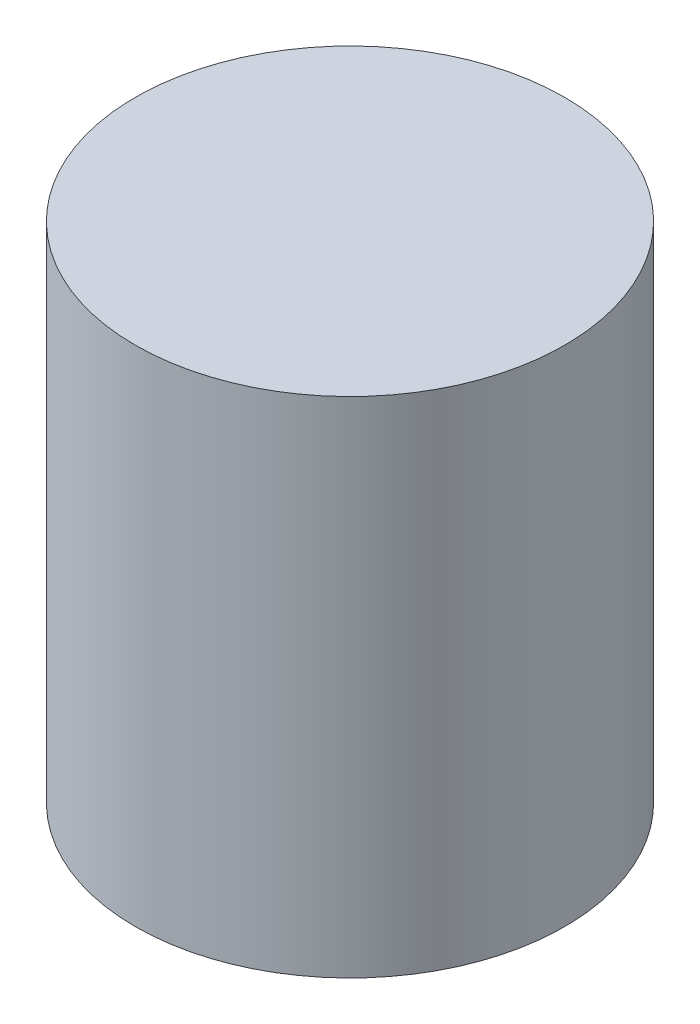
ISO-10303-21;
HEADER;
FILE_DESCRIPTION(('STEP AP214'),'2;1');
FILE_NAME('part.step','',(''),(''),'','','');
FILE_SCHEMA(('AUTOMOTIVE_DESIGN { 1 0 10303 214 1 1 1 1 }'));
ENDSEC;
DATA;
#1=APPLICATION_CONTEXT('core data for automotive mechanical design processes');
#2=APPLICATION_PROTOCOL_DEFINITION('international standard','automotive_design',2000,#1);
#3=PRODUCT_CONTEXT('',#1,'mechanical');
#4=PRODUCT('Part','Part','',(#3));
#5=PRODUCT_RELATED_PRODUCT_CATEGORY('part','',(#4));
#6=PRODUCT_DEFINITION_FORMATION('','',#4);
#7=PRODUCT_DEFINITION_CONTEXT('part definition',#1,'design');
#8=PRODUCT_DEFINITION('design','',#6,#7);
#9=PRODUCT_DEFINITION_SHAPE('','',#8);
#10=(LENGTH_UNIT() NAMED_UNIT(*) SI_UNIT(.MILLI.,.METRE.));
#11=(NAMED_UNIT(*) PLANE_ANGLE_UNIT() SI_UNIT($,.RADIAN.));
#12=(NAMED_UNIT(*) SI_UNIT($,.STERADIAN.) SOLID_ANGLE_UNIT());
#13=UNCERTAINTY_MEASURE_WITH_UNIT(LENGTH_MEASURE(1.E-05),#10,'distance_accuracy_value','');
#14=(GEOMETRIC_REPRESENTATION_CONTEXT(3) GLOBAL_UNCERTAINTY_ASSIGNED_CONTEXT((#13)) GLOBAL_UNIT_ASSIGNED_CONTEXT((#10,
#11,#12)) REPRESENTATION_CONTEXT('',''));
#15=CARTESIAN_POINT('',(0.,0.,0.));
#16=DIRECTION('',(0.,0.,1.));
#17=DIRECTION('',(1.,0.,0.));
#18=AXIS2_PLACEMENT_3D('',#15,#16,#17);
#19=CARTESIAN_POINT('',(0.,0.,0.));
#20=DIRECTION('',(0.,1.,0.));
#21=DIRECTION('',(0.,0.,1.));
#22=AXIS2_PLACEMENT_3D('',#19,#20,#21);
#23=PLANE('',#22);
#24=CARTESIAN_POINT('',(0.,0.,0.));
#25=DIRECTION('',(0.,1.,0.));
#26=DIRECTION('',(0.,0.,1.));
#27=AXIS2_PLACEMENT_3D('',#24,#25,#26);
#28=CIRCLE('',#27,4.05);
#29=CARTESIAN_POINT('',(0.,0.,4.05));
#30=VERTEX_POINT('',#29);
#31=EDGE_CURVE('E10',#30,#30,#28,.T.);
#32=ORIENTED_EDGE('',*,*,#31,.F.);
#33=EDGE_LOOP('',(#32));
#34=FACE_BOUND('',#33,.T.);
#35=CARTESIAN_POINT('',(0.,0.,0.));
#36=DIRECTION('',(0.,1.,0.));
#37=DIRECTION('',(0.,0.,1.));
#38=AXIS2_PLACEMENT_3D('',#35,#36,#37);
#39=CIRCLE('',#38,3.05);
#40=CARTESIAN_POINT('',(0.,0.,3.05));
#41=VERTEX_POINT('',#40);
#42=EDGE_CURVE('E45',#41,#41,#39,.T.);
#43=ORIENTED_EDGE('',*,*,#42,.T.);
#44=EDGE_LOOP('',(#43));
#45=FACE_BOUND('',#44,.T.);
#46=ADVANCED_FACE('F38',(#34,#45),#23,.F.);
#47=CARTESIAN_POINT('',(0.,6.,0.));
#48=DIRECTION('',(0.,-1.,0.));
#49=DIRECTION('',(0.,0.,-1.));
#50=AXIS2_PLACEMENT_3D('',#47,#48,#49);
#51=CYLINDRICAL_SURFACE('',#50,4.05);
#52=ORIENTED_EDGE('',*,*,#31,.T.);
#53=EDGE_LOOP('',(#52));
#54=FACE_BOUND('',#53,.T.);
#55=CARTESIAN_POINT('',(0.,9.5,0.));
#56=DIRECTION('',(0.,1.,0.));
#57=DIRECTION('',(0.,0.,1.));
#58=AXIS2_PLACEMENT_3D('',#55,#56,#57);
#59=CIRCLE('',#58,4.05);
#60=CARTESIAN_POINT('',(0.,9.5,4.05));
#61=VERTEX_POINT('',#60);
#62=EDGE_CURVE('E53',#61,#61,#59,.T.);
#63=ORIENTED_EDGE('',*,*,#62,.F.);
#64=EDGE_LOOP('',(#63));
#65=FACE_BOUND('',#64,.T.);
#66=ADVANCED_FACE('F40',(#54,#65),#51,.T.);
#67=CARTESIAN_POINT('',(0.,6.,0.));
#68=DIRECTION('',(0.,-1.,0.));
#69=DIRECTION('',(0.,0.,-1.));
#70=AXIS2_PLACEMENT_3D('',#67,#68,#69);
#71=CYLINDRICAL_SURFACE('',#70,3.05);
#72=CARTESIAN_POINT('',(0.,6.,0.));
#73=DIRECTION('',(0.,1.,0.));
#74=DIRECTION('',(0.,0.,1.));
#75=AXIS2_PLACEMENT_3D('',#72,#73,#74);
#76=CIRCLE('',#75,3.05);
#77=CARTESIAN_POINT('',(0.,6.,3.05));
#78=VERTEX_POINT('',#77);
#79=EDGE_CURVE('E49',#78,#78,#76,.T.);
#80=ORIENTED_EDGE('',*,*,#79,.T.);
#81=EDGE_LOOP('',(#80));
#82=FACE_BOUND('',#81,.T.);
#83=ORIENTED_EDGE('',*,*,#42,.F.);
#84=EDGE_LOOP('',(#83));
#85=FACE_BOUND('',#84,.T.);
#86=ADVANCED_FACE('F62',(#82,#85),#71,.F.);
#87=CARTESIAN_POINT('',(0.,6.,0.));
#88=DIRECTION('',(0.,1.,0.));
#89=DIRECTION('',(0.,0.,1.));
#90=AXIS2_PLACEMENT_3D('',#87,#88,#89);
#91=PLANE('',#90);
#92=ORIENTED_EDGE('',*,*,#79,.F.);
#93=EDGE_LOOP('',(#92));
#94=FACE_BOUND('',#93,.T.);
#95=ADVANCED_FACE('F67',(#94),#91,.F.);
#96=CARTESIAN_POINT('',(0.,9.5,0.));
#97=DIRECTION('',(0.,1.,0.));
#98=DIRECTION('',(0.,0.,1.));
#99=AXIS2_PLACEMENT_3D('',#96,#97,#98);
#100=PLANE('',#99);
#101=ORIENTED_EDGE('',*,*,#62,.T.);
#102=EDGE_LOOP('',(#101));
#103=FACE_BOUND('',#102,.T.);
#104=ADVANCED_FACE('F59',(#103),#100,.T.);
#105=CLOSED_SHELL('',(#46,#66,#86,#95,#104));
#106=MANIFOLD_SOLID_BREP('B2',#105);
#107=ADVANCED_BREP_SHAPE_REPRESENTATION('',(#18,#106),#14);
#108=SHAPE_DEFINITION_REPRESENTATION(#9,#107);
ENDSEC;
END-ISO-10303-21;
